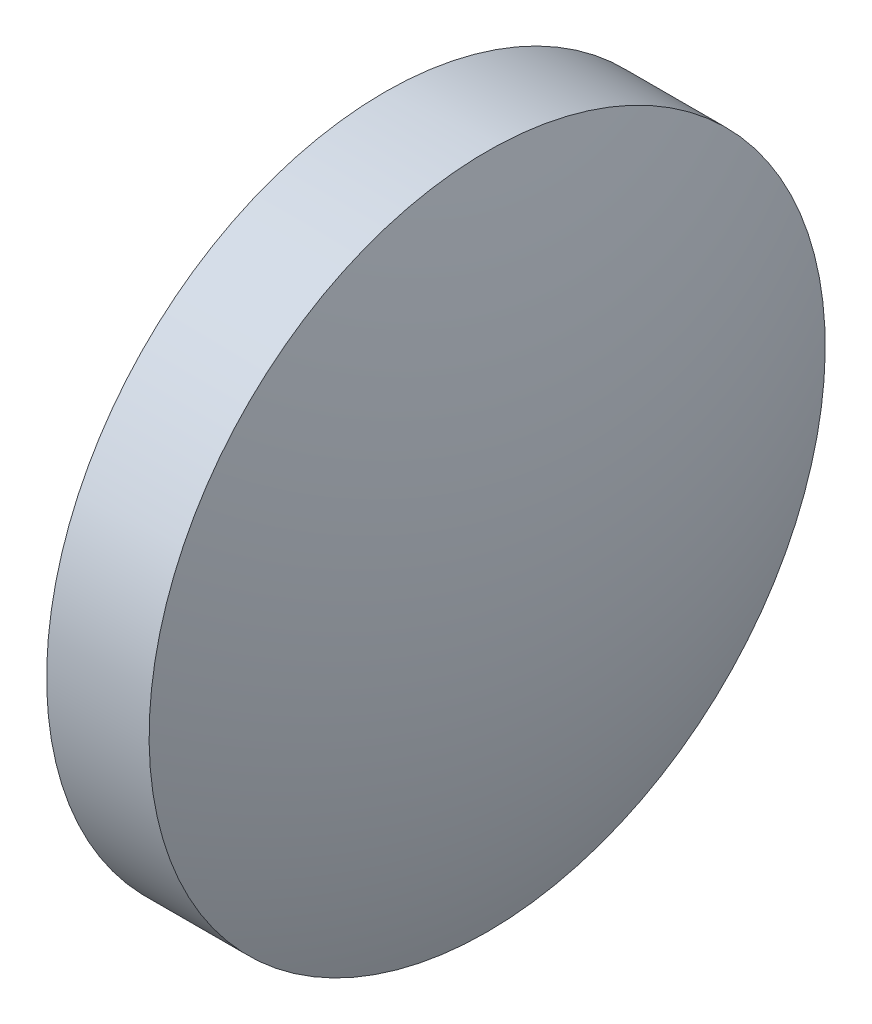
ISO-10303-21;
HEADER;
FILE_DESCRIPTION(('STEP AP214'),'2;1');
FILE_NAME('part.step','',(''),(''),'','','');
FILE_SCHEMA(('AUTOMOTIVE_DESIGN { 1 0 10303 214 1 1 1 1 }'));
ENDSEC;
DATA;
#1=APPLICATION_CONTEXT('core data for automotive mechanical design processes');
#2=APPLICATION_PROTOCOL_DEFINITION('international standard','automotive_design',2000,#1);
#3=PRODUCT_CONTEXT('',#1,'mechanical');
#4=PRODUCT('Part','Part','',(#3));
#5=PRODUCT_RELATED_PRODUCT_CATEGORY('part','',(#4));
#6=PRODUCT_DEFINITION_FORMATION('','',#4);
#7=PRODUCT_DEFINITION_CONTEXT('part definition',#1,'design');
#8=PRODUCT_DEFINITION('design','',#6,#7);
#9=PRODUCT_DEFINITION_SHAPE('','',#8);
#10=(LENGTH_UNIT() NAMED_UNIT(*) SI_UNIT(.MILLI.,.METRE.));
#11=(NAMED_UNIT(*) PLANE_ANGLE_UNIT() SI_UNIT($,.RADIAN.));
#12=(NAMED_UNIT(*) SI_UNIT($,.STERADIAN.) SOLID_ANGLE_UNIT());
#13=UNCERTAINTY_MEASURE_WITH_UNIT(LENGTH_MEASURE(1.E-05),#10,'distance_accuracy_value','');
#14=(GEOMETRIC_REPRESENTATION_CONTEXT(3) GLOBAL_UNCERTAINTY_ASSIGNED_CONTEXT((#13)) GLOBAL_UNIT_ASSIGNED_CONTEXT((#10,
#11,#12)) REPRESENTATION_CONTEXT('',''));
#15=CARTESIAN_POINT('',(0.,0.,0.));
#16=DIRECTION('',(0.,0.,1.));
#17=DIRECTION('',(1.,0.,0.));
#18=AXIS2_PLACEMENT_3D('',#15,#16,#17);
#19=CARTESIAN_POINT('',(60.0448137154566,24.8823336633032,0.));
#20=DIRECTION('',(-1.,0.,0.));
#21=DIRECTION('',(0.,1.,0.));
#22=AXIS2_PLACEMENT_3D('',#19,#20,#21);
#23=SPHERICAL_SURFACE('',#22,17.9944306294674);
#24=CARTESIAN_POINT('',(43.2653830859893,24.8823336633032,0.));
#25=DIRECTION('',(-1.,0.,0.));
#26=DIRECTION('',(0.,-1.,0.));
#27=AXIS2_PLACEMENT_3D('',#24,#25,#26);
#28=CIRCLE('',#27,6.50001857148162);
#29=CARTESIAN_POINT('',(43.2653830859893,18.3823150918216,0.));
#30=VERTEX_POINT('',#29);
#31=EDGE_CURVE('E41',#30,#30,#28,.T.);
#32=ORIENTED_EDGE('',*,*,#31,.T.);
#33=EDGE_LOOP('',(#32));
#34=FACE_BOUND('',#33,.T.);
#35=ADVANCED_FACE('F35',(#34),#23,.T.);
#36=CARTESIAN_POINT('',(28.4559524565216,24.8823336633032,0.));
#37=DIRECTION('',(-1.,0.,0.));
#38=DIRECTION('',(0.,-1.,0.));
#39=AXIS2_PLACEMENT_3D('',#36,#37,#38);
#40=SPHERICAL_SURFACE('',#39,17.9944306294677);
#41=CARTESIAN_POINT('',(45.2353830859893,24.8823336633032,0.));
#42=DIRECTION('',(-1.,0.,0.));
#43=DIRECTION('',(0.,-1.,0.));
#44=AXIS2_PLACEMENT_3D('',#41,#42,#43);
#45=CIRCLE('',#44,6.50001857148161);
#46=CARTESIAN_POINT('',(45.2353830859893,18.3823150918216,0.));
#47=VERTEX_POINT('',#46);
#48=EDGE_CURVE('E10',#47,#47,#45,.T.);
#49=ORIENTED_EDGE('',*,*,#48,.F.);
#50=EDGE_LOOP('',(#49));
#51=FACE_BOUND('',#50,.T.);
#52=ADVANCED_FACE('F50',(#51),#40,.T.);
#53=CARTESIAN_POINT('',(40.9599614001291,24.8823336633032,0.));
#54=DIRECTION('',(-1.,0.,0.));
#55=DIRECTION('',(0.,-1.,0.));
#56=AXIS2_PLACEMENT_3D('',#53,#54,#55);
#57=CYLINDRICAL_SURFACE('',#56,6.50001857148161);
#58=ORIENTED_EDGE('',*,*,#48,.T.);
#59=EDGE_LOOP('',(#58));
#60=FACE_BOUND('',#59,.T.);
#61=ORIENTED_EDGE('',*,*,#31,.F.);
#62=EDGE_LOOP('',(#61));
#63=FACE_BOUND('',#62,.T.);
#64=ADVANCED_FACE('F48',(#60,#63),#57,.T.);
#65=CLOSED_SHELL('',(#35,#52,#64));
#66=MANIFOLD_SOLID_BREP('B2',#65);
#67=ADVANCED_BREP_SHAPE_REPRESENTATION('',(#18,#66),#14);
#68=SHAPE_DEFINITION_REPRESENTATION(#9,#67);
ENDSEC;
END-ISO-10303-21;
